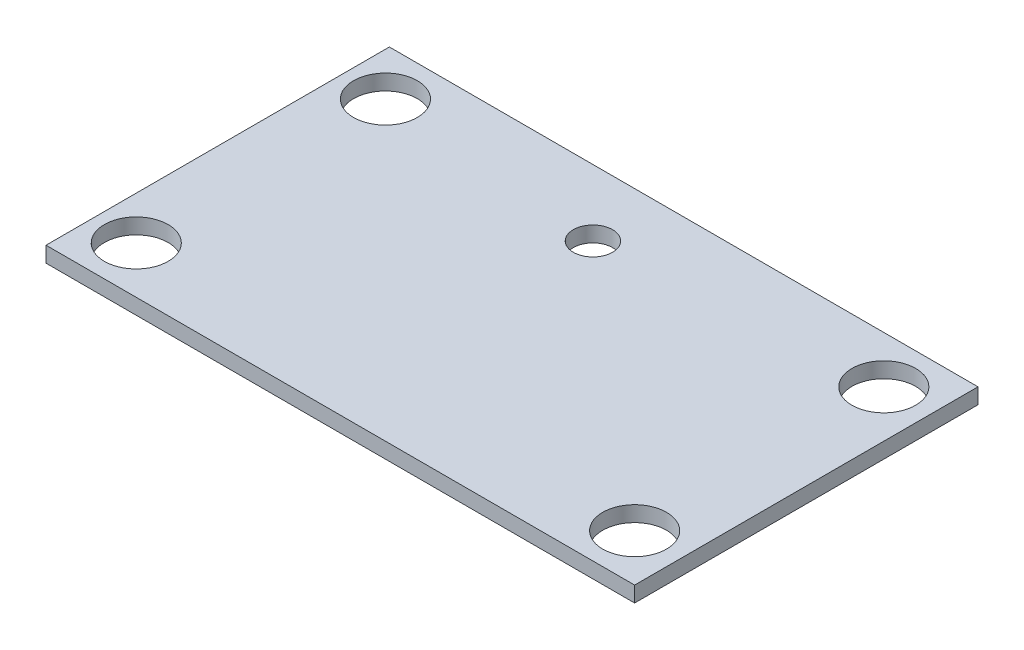
ISO-10303-21;
HEADER;
FILE_DESCRIPTION(('STEP AP214'),'2;1');
FILE_NAME('part.step','',(''),(''),'','','');
FILE_SCHEMA(('AUTOMOTIVE_DESIGN { 1 0 10303 214 1 1 1 1 }'));
ENDSEC;
DATA;
#1=APPLICATION_CONTEXT('core data for automotive mechanical design processes');
#2=APPLICATION_PROTOCOL_DEFINITION('international standard','automotive_design',2000,#1);
#3=PRODUCT_CONTEXT('',#1,'mechanical');
#4=PRODUCT('Part','Part','',(#3));
#5=PRODUCT_RELATED_PRODUCT_CATEGORY('part','',(#4));
#6=PRODUCT_DEFINITION_FORMATION('','',#4);
#7=PRODUCT_DEFINITION_CONTEXT('part definition',#1,'design');
#8=PRODUCT_DEFINITION('design','',#6,#7);
#9=PRODUCT_DEFINITION_SHAPE('','',#8);
#10=(LENGTH_UNIT() NAMED_UNIT(*) SI_UNIT(.MILLI.,.METRE.));
#11=(NAMED_UNIT(*) PLANE_ANGLE_UNIT() SI_UNIT($,.RADIAN.));
#12=(NAMED_UNIT(*) SI_UNIT($,.STERADIAN.) SOLID_ANGLE_UNIT());
#13=UNCERTAINTY_MEASURE_WITH_UNIT(LENGTH_MEASURE(1.E-05),#10,'distance_accuracy_value','');
#14=(GEOMETRIC_REPRESENTATION_CONTEXT(3) GLOBAL_UNCERTAINTY_ASSIGNED_CONTEXT((#13)) GLOBAL_UNIT_ASSIGNED_CONTEXT((#10,
#11,#12)) REPRESENTATION_CONTEXT('',''));
#15=CARTESIAN_POINT('',(0.,0.,0.));
#16=DIRECTION('',(0.,0.,1.));
#17=DIRECTION('',(1.,0.,0.));
#18=AXIS2_PLACEMENT_3D('',#15,#16,#17);
#19=CARTESIAN_POINT('',(0.,1.5875,0.));
#20=DIRECTION('',(0.,-1.,0.));
#21=DIRECTION('',(0.,0.,-1.));
#22=AXIS2_PLACEMENT_3D('',#19,#20,#21);
#23=PLANE('',#22);
#24=CARTESIAN_POINT('',(-2.5,1.5875,-10.75));
#25=DIRECTION('',(0.,1.,0.));
#26=DIRECTION('',(0.,0.,1.));
#27=AXIS2_PLACEMENT_3D('',#24,#25,#26);
#28=CIRCLE('',#27,2.);
#29=CARTESIAN_POINT('',(-2.5,1.5875,-8.75));
#30=VERTEX_POINT('',#29);
#31=EDGE_CURVE('E166',#30,#30,#28,.T.);
#32=ORIENTED_EDGE('',*,*,#31,.F.);
#33=EDGE_LOOP('',(#32));
#34=FACE_BOUND('',#33,.T.);
#35=DIRECTION('',(0.,0.,-1.));
#36=VECTOR('',#35,1.);
#37=CARTESIAN_POINT('',(30.,1.5875,17.5));
#38=LINE('',#37,#36);
#39=CARTESIAN_POINT('',(30.,1.5875,17.5));
#40=VERTEX_POINT('',#39);
#41=CARTESIAN_POINT('',(30.,1.5875,-17.5));
#42=VERTEX_POINT('',#41);
#43=EDGE_CURVE('E96',#40,#42,#38,.T.);
#44=ORIENTED_EDGE('',*,*,#43,.T.);
#45=DIRECTION('',(-1.,0.,0.));
#46=VECTOR('',#45,1.);
#47=CARTESIAN_POINT('',(-30.,1.5875,-17.5));
#48=LINE('',#47,#46);
#49=CARTESIAN_POINT('',(-30.,1.5875,-17.5));
#50=VERTEX_POINT('',#49);
#51=EDGE_CURVE('E91',#42,#50,#48,.T.);
#52=ORIENTED_EDGE('',*,*,#51,.T.);
#53=DIRECTION('',(0.,0.,1.));
#54=VECTOR('',#53,1.);
#55=CARTESIAN_POINT('',(-30.,1.5875,17.5));
#56=LINE('',#55,#54);
#57=CARTESIAN_POINT('',(-30.,1.5875,17.5));
#58=VERTEX_POINT('',#57);
#59=EDGE_CURVE('E94',#50,#58,#56,.T.);
#60=ORIENTED_EDGE('',*,*,#59,.T.);
#61=DIRECTION('',(1.,0.,0.));
#62=VECTOR('',#61,1.);
#63=CARTESIAN_POINT('',(-30.,1.5875,17.5));
#64=LINE('',#63,#62);
#65=EDGE_CURVE('E61',#58,#40,#64,.T.);
#66=ORIENTED_EDGE('',*,*,#65,.T.);
#67=EDGE_LOOP('',(#44,#52,#60,#66));
#68=FACE_BOUND('',#67,.T.);
#69=CARTESIAN_POINT('',(-25.6,1.5875,-12.7));
#70=DIRECTION('',(0.,1.,0.));
#71=DIRECTION('',(0.,0.,1.));
#72=AXIS2_PLACEMENT_3D('',#69,#70,#71);
#73=CIRCLE('',#72,3.25);
#74=CARTESIAN_POINT('',(-25.6,1.5875,-9.45));
#75=VERTEX_POINT('',#74);
#76=EDGE_CURVE('E116',#75,#75,#73,.T.);
#77=ORIENTED_EDGE('',*,*,#76,.F.);
#78=EDGE_LOOP('',(#77));
#79=FACE_BOUND('',#78,.T.);
#80=CARTESIAN_POINT('',(25.2,1.5875,-12.7));
#81=DIRECTION('',(0.,1.,0.));
#82=DIRECTION('',(0.,0.,1.));
#83=AXIS2_PLACEMENT_3D('',#80,#81,#82);
#84=CIRCLE('',#83,3.25);
#85=CARTESIAN_POINT('',(25.2,1.5875,-9.45));
#86=VERTEX_POINT('',#85);
#87=EDGE_CURVE('E138',#86,#86,#84,.T.);
#88=ORIENTED_EDGE('',*,*,#87,.F.);
#89=EDGE_LOOP('',(#88));
#90=FACE_BOUND('',#89,.T.);
#91=CARTESIAN_POINT('',(25.2,1.5875,12.7));
#92=DIRECTION('',(0.,1.,0.));
#93=DIRECTION('',(0.,0.,1.));
#94=AXIS2_PLACEMENT_3D('',#91,#92,#93);
#95=CIRCLE('',#94,3.25);
#96=CARTESIAN_POINT('',(25.2,1.5875,15.95));
#97=VERTEX_POINT('',#96);
#98=EDGE_CURVE('E146',#97,#97,#95,.T.);
#99=ORIENTED_EDGE('',*,*,#98,.F.);
#100=EDGE_LOOP('',(#99));
#101=FACE_BOUND('',#100,.T.);
#102=CARTESIAN_POINT('',(-25.6,1.5875,12.7));
#103=DIRECTION('',(0.,1.,0.));
#104=DIRECTION('',(0.,0.,1.));
#105=AXIS2_PLACEMENT_3D('',#102,#103,#104);
#106=CIRCLE('',#105,3.25);
#107=CARTESIAN_POINT('',(-25.6,1.5875,15.95));
#108=VERTEX_POINT('',#107);
#109=EDGE_CURVE('E154',#108,#108,#106,.T.);
#110=ORIENTED_EDGE('',*,*,#109,.F.);
#111=EDGE_LOOP('',(#110));
#112=FACE_BOUND('',#111,.T.);
#113=ADVANCED_FACE('F43',(#34,#68,#79,#90,#101,#112),#23,.F.);
#114=CARTESIAN_POINT('',(0.,0.,0.));
#115=DIRECTION('',(0.,-1.,0.));
#116=DIRECTION('',(0.,0.,-1.));
#117=AXIS2_PLACEMENT_3D('',#114,#115,#116);
#118=PLANE('',#117);
#119=CARTESIAN_POINT('',(-2.5,0.,-10.75));
#120=DIRECTION('',(0.,1.,0.));
#121=DIRECTION('',(0.,0.,1.));
#122=AXIS2_PLACEMENT_3D('',#119,#120,#121);
#123=CIRCLE('',#122,2.);
#124=CARTESIAN_POINT('',(-2.5,0.,-8.75));
#125=VERTEX_POINT('',#124);
#126=EDGE_CURVE('E162',#125,#125,#123,.T.);
#127=ORIENTED_EDGE('',*,*,#126,.T.);
#128=EDGE_LOOP('',(#127));
#129=FACE_BOUND('',#128,.T.);
#130=CARTESIAN_POINT('',(25.2,0.,12.7));
#131=DIRECTION('',(0.,1.,0.));
#132=DIRECTION('',(0.,0.,1.));
#133=AXIS2_PLACEMENT_3D('',#130,#131,#132);
#134=CIRCLE('',#133,3.25);
#135=CARTESIAN_POINT('',(25.2,0.,15.95));
#136=VERTEX_POINT('',#135);
#137=EDGE_CURVE('E150',#136,#136,#134,.T.);
#138=ORIENTED_EDGE('',*,*,#137,.T.);
#139=EDGE_LOOP('',(#138));
#140=FACE_BOUND('',#139,.T.);
#141=CARTESIAN_POINT('',(-25.6,0.,-12.7));
#142=DIRECTION('',(0.,1.,0.));
#143=DIRECTION('',(0.,0.,1.));
#144=AXIS2_PLACEMENT_3D('',#141,#142,#143);
#145=CIRCLE('',#144,3.25);
#146=CARTESIAN_POINT('',(-25.6,0.,-9.45));
#147=VERTEX_POINT('',#146);
#148=EDGE_CURVE('E134',#147,#147,#145,.T.);
#149=ORIENTED_EDGE('',*,*,#148,.T.);
#150=EDGE_LOOP('',(#149));
#151=FACE_BOUND('',#150,.T.);
#152=DIRECTION('',(0.,0.,-1.));
#153=VECTOR('',#152,1.);
#154=CARTESIAN_POINT('',(30.,0.,17.5));
#155=LINE('',#154,#153);
#156=CARTESIAN_POINT('',(30.,0.,17.5));
#157=VERTEX_POINT('',#156);
#158=CARTESIAN_POINT('',(30.,0.,-17.5));
#159=VERTEX_POINT('',#158);
#160=EDGE_CURVE('E112',#157,#159,#155,.T.);
#161=ORIENTED_EDGE('',*,*,#160,.F.);
#162=DIRECTION('',(1.,0.,0.));
#163=VECTOR('',#162,1.);
#164=CARTESIAN_POINT('',(-30.,0.,17.5));
#165=LINE('',#164,#163);
#166=CARTESIAN_POINT('',(-30.,0.,17.5));
#167=VERTEX_POINT('',#166);
#168=EDGE_CURVE('E84',#167,#157,#165,.T.);
#169=ORIENTED_EDGE('',*,*,#168,.F.);
#170=DIRECTION('',(0.,0.,1.));
#171=VECTOR('',#170,1.);
#172=CARTESIAN_POINT('',(-30.,0.,17.5));
#173=LINE('',#172,#171);
#174=CARTESIAN_POINT('',(-30.,0.,-17.5));
#175=VERTEX_POINT('',#174);
#176=EDGE_CURVE('E78',#175,#167,#173,.T.);
#177=ORIENTED_EDGE('',*,*,#176,.F.);
#178=DIRECTION('',(-1.,0.,0.));
#179=VECTOR('',#178,1.);
#180=CARTESIAN_POINT('',(-30.,0.,-17.5));
#181=LINE('',#180,#179);
#182=EDGE_CURVE('E101',#159,#175,#181,.T.);
#183=ORIENTED_EDGE('',*,*,#182,.F.);
#184=EDGE_LOOP('',(#161,#169,#177,#183));
#185=FACE_BOUND('',#184,.T.);
#186=CARTESIAN_POINT('',(25.2,0.,-12.7));
#187=DIRECTION('',(0.,1.,0.));
#188=DIRECTION('',(0.,0.,1.));
#189=AXIS2_PLACEMENT_3D('',#186,#187,#188);
#190=CIRCLE('',#189,3.25);
#191=CARTESIAN_POINT('',(25.2,0.,-9.45));
#192=VERTEX_POINT('',#191);
#193=EDGE_CURVE('E142',#192,#192,#190,.T.);
#194=ORIENTED_EDGE('',*,*,#193,.T.);
#195=EDGE_LOOP('',(#194));
#196=FACE_BOUND('',#195,.T.);
#197=CARTESIAN_POINT('',(-25.6,0.,12.7));
#198=DIRECTION('',(0.,1.,0.));
#199=DIRECTION('',(0.,0.,1.));
#200=AXIS2_PLACEMENT_3D('',#197,#198,#199);
#201=CIRCLE('',#200,3.25);
#202=CARTESIAN_POINT('',(-25.6,0.,15.95));
#203=VERTEX_POINT('',#202);
#204=EDGE_CURVE('E158',#203,#203,#201,.T.);
#205=ORIENTED_EDGE('',*,*,#204,.T.);
#206=EDGE_LOOP('',(#205));
#207=FACE_BOUND('',#206,.T.);
#208=ADVANCED_FACE('F129',(#129,#140,#151,#185,#196,#207),#118,.T.);
#209=CARTESIAN_POINT('',(30.,1.5875,17.5));
#210=DIRECTION('',(-1.,0.,0.));
#211=DIRECTION('',(0.,0.,1.));
#212=AXIS2_PLACEMENT_3D('',#209,#210,#211);
#213=PLANE('',#212);
#214=ORIENTED_EDGE('',*,*,#160,.T.);
#215=DIRECTION('',(0.,-1.,0.));
#216=VECTOR('',#215,1.);
#217=CARTESIAN_POINT('',(30.,1.5875,-17.5));
#218=LINE('',#217,#216);
#219=EDGE_CURVE('E11',#42,#159,#218,.T.);
#220=ORIENTED_EDGE('',*,*,#219,.F.);
#221=ORIENTED_EDGE('',*,*,#43,.F.);
#222=DIRECTION('',(0.,-1.,0.));
#223=VECTOR('',#222,1.);
#224=CARTESIAN_POINT('',(30.,1.5875,17.5));
#225=LINE('',#224,#223);
#226=EDGE_CURVE('E108',#40,#157,#225,.T.);
#227=ORIENTED_EDGE('',*,*,#226,.T.);
#228=EDGE_LOOP('',(#214,#220,#221,#227));
#229=FACE_BOUND('',#228,.T.);
#230=ADVANCED_FACE('F45',(#229),#213,.F.);
#231=CARTESIAN_POINT('',(-30.,1.5875,-17.5));
#232=DIRECTION('',(0.,0.,1.));
#233=DIRECTION('',(1.,0.,0.));
#234=AXIS2_PLACEMENT_3D('',#231,#232,#233);
#235=PLANE('',#234);
#236=ORIENTED_EDGE('',*,*,#182,.T.);
#237=DIRECTION('',(0.,-1.,0.));
#238=VECTOR('',#237,1.);
#239=CARTESIAN_POINT('',(-30.,1.5875,-17.5));
#240=LINE('',#239,#238);
#241=EDGE_CURVE('E53',#50,#175,#240,.T.);
#242=ORIENTED_EDGE('',*,*,#241,.F.);
#243=ORIENTED_EDGE('',*,*,#51,.F.);
#244=ORIENTED_EDGE('',*,*,#219,.T.);
#245=EDGE_LOOP('',(#236,#242,#243,#244));
#246=FACE_BOUND('',#245,.T.);
#247=ADVANCED_FACE('F100',(#246),#235,.F.);
#248=CARTESIAN_POINT('',(-30.,1.5875,17.5));
#249=DIRECTION('',(1.,0.,0.));
#250=DIRECTION('',(0.,0.,-1.));
#251=AXIS2_PLACEMENT_3D('',#248,#249,#250);
#252=PLANE('',#251);
#253=ORIENTED_EDGE('',*,*,#176,.T.);
#254=DIRECTION('',(0.,-1.,0.));
#255=VECTOR('',#254,1.);
#256=CARTESIAN_POINT('',(-30.,1.5875,17.5));
#257=LINE('',#256,#255);
#258=EDGE_CURVE('E103',#58,#167,#257,.T.);
#259=ORIENTED_EDGE('',*,*,#258,.F.);
#260=ORIENTED_EDGE('',*,*,#59,.F.);
#261=ORIENTED_EDGE('',*,*,#241,.T.);
#262=EDGE_LOOP('',(#253,#259,#260,#261));
#263=FACE_BOUND('',#262,.T.);
#264=ADVANCED_FACE('F104',(#263),#252,.F.);
#265=CARTESIAN_POINT('',(-30.,1.5875,17.5));
#266=DIRECTION('',(0.,0.,-1.));
#267=DIRECTION('',(-1.,0.,0.));
#268=AXIS2_PLACEMENT_3D('',#265,#266,#267);
#269=PLANE('',#268);
#270=ORIENTED_EDGE('',*,*,#168,.T.);
#271=ORIENTED_EDGE('',*,*,#226,.F.);
#272=ORIENTED_EDGE('',*,*,#65,.F.);
#273=ORIENTED_EDGE('',*,*,#258,.T.);
#274=EDGE_LOOP('',(#270,#271,#272,#273));
#275=FACE_BOUND('',#274,.T.);
#276=ADVANCED_FACE('F126',(#275),#269,.F.);
#277=CARTESIAN_POINT('',(-25.6,1.5875,-12.7));
#278=DIRECTION('',(0.,-1.,0.));
#279=DIRECTION('',(0.,0.,-1.));
#280=AXIS2_PLACEMENT_3D('',#277,#278,#279);
#281=CYLINDRICAL_SURFACE('',#280,3.25);
#282=ORIENTED_EDGE('',*,*,#76,.T.);
#283=EDGE_LOOP('',(#282));
#284=FACE_BOUND('',#283,.T.);
#285=ORIENTED_EDGE('',*,*,#148,.F.);
#286=EDGE_LOOP('',(#285));
#287=FACE_BOUND('',#286,.T.);
#288=ADVANCED_FACE('F190',(#284,#287),#281,.F.);
#289=CARTESIAN_POINT('',(25.2,1.5875,-12.7));
#290=DIRECTION('',(0.,-1.,0.));
#291=DIRECTION('',(0.,0.,-1.));
#292=AXIS2_PLACEMENT_3D('',#289,#290,#291);
#293=CYLINDRICAL_SURFACE('',#292,3.25);
#294=ORIENTED_EDGE('',*,*,#87,.T.);
#295=EDGE_LOOP('',(#294));
#296=FACE_BOUND('',#295,.T.);
#297=ORIENTED_EDGE('',*,*,#193,.F.);
#298=EDGE_LOOP('',(#297));
#299=FACE_BOUND('',#298,.T.);
#300=ADVANCED_FACE('F232',(#296,#299),#293,.F.);
#301=CARTESIAN_POINT('',(25.2,1.5875,12.7));
#302=DIRECTION('',(0.,-1.,0.));
#303=DIRECTION('',(0.,0.,-1.));
#304=AXIS2_PLACEMENT_3D('',#301,#302,#303);
#305=CYLINDRICAL_SURFACE('',#304,3.25);
#306=ORIENTED_EDGE('',*,*,#98,.T.);
#307=EDGE_LOOP('',(#306));
#308=FACE_BOUND('',#307,.T.);
#309=ORIENTED_EDGE('',*,*,#137,.F.);
#310=EDGE_LOOP('',(#309));
#311=FACE_BOUND('',#310,.T.);
#312=ADVANCED_FACE('F225',(#308,#311),#305,.F.);
#313=CARTESIAN_POINT('',(-25.6,1.5875,12.7));
#314=DIRECTION('',(0.,-1.,0.));
#315=DIRECTION('',(0.,0.,-1.));
#316=AXIS2_PLACEMENT_3D('',#313,#314,#315);
#317=CYLINDRICAL_SURFACE('',#316,3.25);
#318=ORIENTED_EDGE('',*,*,#109,.T.);
#319=EDGE_LOOP('',(#318));
#320=FACE_BOUND('',#319,.T.);
#321=ORIENTED_EDGE('',*,*,#204,.F.);
#322=EDGE_LOOP('',(#321));
#323=FACE_BOUND('',#322,.T.);
#324=ADVANCED_FACE('F179',(#320,#323),#317,.F.);
#325=CARTESIAN_POINT('',(-2.5,0.,-10.75));
#326=DIRECTION('',(0.,1.,0.));
#327=DIRECTION('',(0.,0.,1.));
#328=AXIS2_PLACEMENT_3D('',#325,#326,#327);
#329=CYLINDRICAL_SURFACE('',#328,2.);
#330=ORIENTED_EDGE('',*,*,#126,.F.);
#331=EDGE_LOOP('',(#330));
#332=FACE_BOUND('',#331,.T.);
#333=ORIENTED_EDGE('',*,*,#31,.T.);
#334=EDGE_LOOP('',(#333));
#335=FACE_BOUND('',#334,.T.);
#336=ADVANCED_FACE('F176',(#332,#335),#329,.F.);
#337=CLOSED_SHELL('',(#113,#208,#230,#247,#264,#276,#288,#300,#312,#324,#336));
#338=MANIFOLD_SOLID_BREP('B2',#337);
#339=ADVANCED_BREP_SHAPE_REPRESENTATION('',(#18,#338),#14);
#340=SHAPE_DEFINITION_REPRESENTATION(#9,#339);
ENDSEC;
END-ISO-10303-21;
